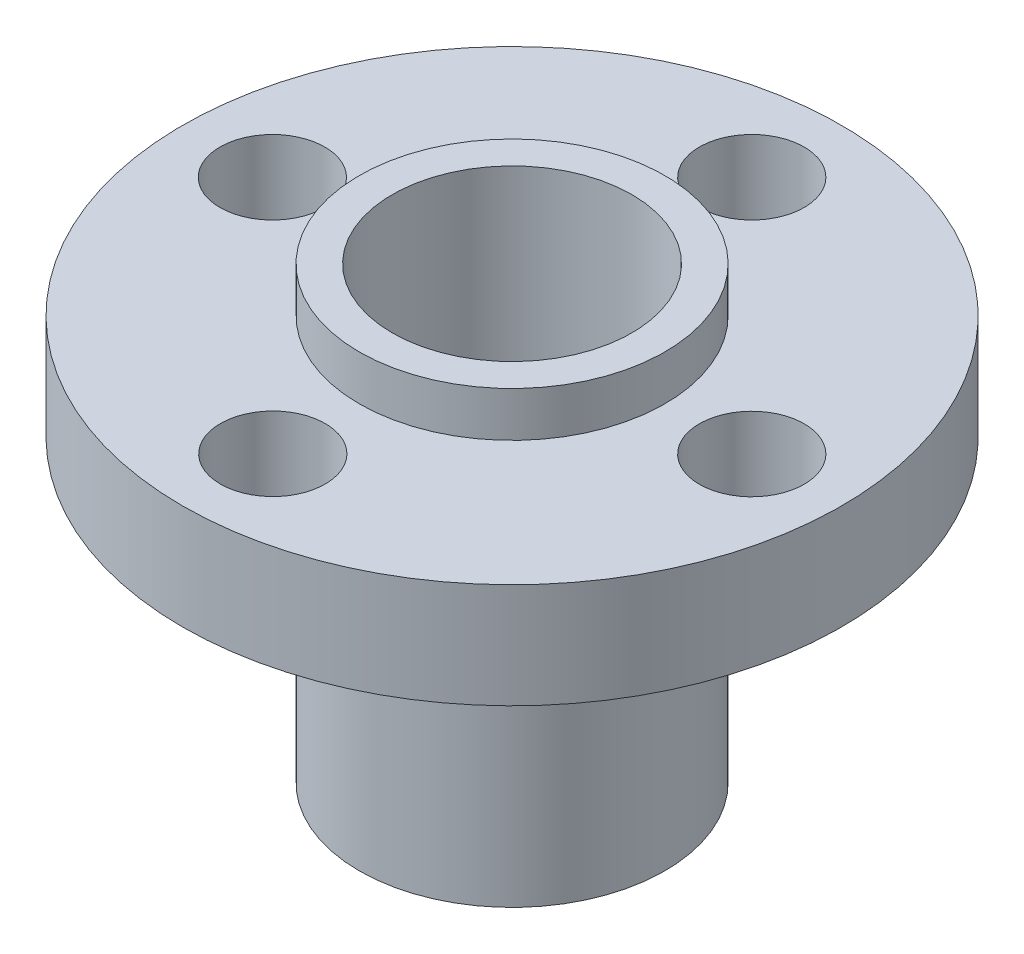
ISO-10303-21;
HEADER;
FILE_DESCRIPTION(('STEP AP214'),'2;1');
FILE_NAME('part.step','',(''),(''),'','','');
FILE_SCHEMA(('AUTOMOTIVE_DESIGN { 1 0 10303 214 1 1 1 1 }'));
ENDSEC;
DATA;
#1=APPLICATION_CONTEXT('core data for automotive mechanical design processes');
#2=APPLICATION_PROTOCOL_DEFINITION('international standard','automotive_design',2000,#1);
#3=PRODUCT_CONTEXT('',#1,'mechanical');
#4=PRODUCT('Part','Part','',(#3));
#5=PRODUCT_RELATED_PRODUCT_CATEGORY('part','',(#4));
#6=PRODUCT_DEFINITION_FORMATION('','',#4);
#7=PRODUCT_DEFINITION_CONTEXT('part definition',#1,'design');
#8=PRODUCT_DEFINITION('design','',#6,#7);
#9=PRODUCT_DEFINITION_SHAPE('','',#8);
#10=(LENGTH_UNIT() NAMED_UNIT(*) SI_UNIT(.MILLI.,.METRE.));
#11=(NAMED_UNIT(*) PLANE_ANGLE_UNIT() SI_UNIT($,.RADIAN.));
#12=(NAMED_UNIT(*) SI_UNIT($,.STERADIAN.) SOLID_ANGLE_UNIT());
#13=UNCERTAINTY_MEASURE_WITH_UNIT(LENGTH_MEASURE(1.E-05),#10,'distance_accuracy_value','');
#14=(GEOMETRIC_REPRESENTATION_CONTEXT(3) GLOBAL_UNCERTAINTY_ASSIGNED_CONTEXT((#13)) GLOBAL_UNIT_ASSIGNED_CONTEXT((#10,
#11,#12)) REPRESENTATION_CONTEXT('',''));
#15=CARTESIAN_POINT('',(0.,0.,0.));
#16=DIRECTION('',(0.,0.,1.));
#17=DIRECTION('',(1.,0.,0.));
#18=AXIS2_PLACEMENT_3D('',#15,#16,#17);
#19=CARTESIAN_POINT('',(-9.89044002391512,3.5,4.26796703500969));
#20=DIRECTION('',(0.,-1.,0.));
#21=DIRECTION('',(0.,0.,-1.));
#22=AXIS2_PLACEMENT_3D('',#19,#20,#21);
#23=CYLINDRICAL_SURFACE('',#22,1.75);
#24=CARTESIAN_POINT('',(-9.89044002391512,3.5,4.26796703500969));
#25=DIRECTION('',(0.,1.,0.));
#26=DIRECTION('',(0.,0.,1.));
#27=AXIS2_PLACEMENT_3D('',#24,#25,#26);
#28=CIRCLE('',#27,1.75);
#29=CARTESIAN_POINT('',(-9.89044002391512,3.5,6.01796703500969));
#30=VERTEX_POINT('',#29);
#31=EDGE_CURVE('E40',#30,#30,#28,.T.);
#32=ORIENTED_EDGE('',*,*,#31,.T.);
#33=EDGE_LOOP('',(#32));
#34=FACE_BOUND('',#33,.T.);
#35=CARTESIAN_POINT('',(-9.89044002391512,0.,4.26796703500969));
#36=DIRECTION('',(0.,1.,0.));
#37=DIRECTION('',(0.,0.,1.));
#38=AXIS2_PLACEMENT_3D('',#35,#36,#37);
#39=CIRCLE('',#38,1.75);
#40=CARTESIAN_POINT('',(-9.89044002391512,0.,6.01796703500969));
#41=VERTEX_POINT('',#40);
#42=EDGE_CURVE('E58',#41,#41,#39,.T.);
#43=ORIENTED_EDGE('',*,*,#42,.F.);
#44=EDGE_LOOP('',(#43));
#45=FACE_BOUND('',#44,.T.);
#46=ADVANCED_FACE('F32',(#34,#45),#23,.F.);
#47=CARTESIAN_POINT('',(-1.89044002391511,3.5,-3.71851279819777));
#48=DIRECTION('',(0.,-1.,0.));
#49=DIRECTION('',(0.,0.,-1.));
#50=AXIS2_PLACEMENT_3D('',#47,#48,#49);
#51=CYLINDRICAL_SURFACE('',#50,1.75);
#52=CARTESIAN_POINT('',(-1.89044002391511,3.5,-3.71851279819777));
#53=DIRECTION('',(0.,1.,0.));
#54=DIRECTION('',(0.,0.,1.));
#55=AXIS2_PLACEMENT_3D('',#52,#53,#54);
#56=CIRCLE('',#55,1.75);
#57=CARTESIAN_POINT('',(-1.89044002391511,3.5,-1.96851279819777));
#58=VERTEX_POINT('',#57);
#59=EDGE_CURVE('E45',#58,#58,#56,.T.);
#60=ORIENTED_EDGE('',*,*,#59,.T.);
#61=EDGE_LOOP('',(#60));
#62=FACE_BOUND('',#61,.T.);
#63=CARTESIAN_POINT('',(-1.89044002391511,0.,-3.71851279819777));
#64=DIRECTION('',(0.,1.,0.));
#65=DIRECTION('',(0.,0.,1.));
#66=AXIS2_PLACEMENT_3D('',#63,#64,#65);
#67=CIRCLE('',#66,1.75);
#68=CARTESIAN_POINT('',(-1.89044002391511,0.,-1.96851279819777));
#69=VERTEX_POINT('',#68);
#70=EDGE_CURVE('E56',#69,#69,#67,.T.);
#71=ORIENTED_EDGE('',*,*,#70,.F.);
#72=EDGE_LOOP('',(#71));
#73=FACE_BOUND('',#72,.T.);
#74=ADVANCED_FACE('F79',(#62,#73),#51,.F.);
#75=CARTESIAN_POINT('',(-9.89044002391512,3.5,-11.7185127981978));
#76=DIRECTION('',(0.,-1.,0.));
#77=DIRECTION('',(0.,0.,-1.));
#78=AXIS2_PLACEMENT_3D('',#75,#76,#77);
#79=CYLINDRICAL_SURFACE('',#78,1.75);
#80=CARTESIAN_POINT('',(-9.89044002391512,3.5,-11.7185127981978));
#81=DIRECTION('',(0.,1.,0.));
#82=DIRECTION('',(0.,0.,1.));
#83=AXIS2_PLACEMENT_3D('',#80,#81,#82);
#84=CIRCLE('',#83,1.75);
#85=CARTESIAN_POINT('',(-9.89044002391512,3.5,-9.96851279819777));
#86=VERTEX_POINT('',#85);
#87=EDGE_CURVE('E67',#86,#86,#84,.T.);
#88=ORIENTED_EDGE('',*,*,#87,.T.);
#89=EDGE_LOOP('',(#88));
#90=FACE_BOUND('',#89,.T.);
#91=CARTESIAN_POINT('',(-9.89044002391512,0.,-11.7185127981978));
#92=DIRECTION('',(0.,1.,0.));
#93=DIRECTION('',(0.,0.,1.));
#94=AXIS2_PLACEMENT_3D('',#91,#92,#93);
#95=CIRCLE('',#94,1.75);
#96=CARTESIAN_POINT('',(-9.89044002391512,0.,-9.96851279819777));
#97=VERTEX_POINT('',#96);
#98=EDGE_CURVE('E52',#97,#97,#95,.T.);
#99=ORIENTED_EDGE('',*,*,#98,.F.);
#100=EDGE_LOOP('',(#99));
#101=FACE_BOUND('',#100,.T.);
#102=ADVANCED_FACE('F97',(#90,#101),#79,.F.);
#103=CARTESIAN_POINT('',(-17.8904400239151,3.5,-3.71851279819777));
#104=DIRECTION('',(0.,-1.,0.));
#105=DIRECTION('',(0.,0.,-1.));
#106=AXIS2_PLACEMENT_3D('',#103,#104,#105);
#107=CYLINDRICAL_SURFACE('',#106,1.75);
#108=CARTESIAN_POINT('',(-17.8904400239151,3.5,-3.71851279819777));
#109=DIRECTION('',(0.,1.,0.));
#110=DIRECTION('',(0.,0.,1.));
#111=AXIS2_PLACEMENT_3D('',#108,#109,#110);
#112=CIRCLE('',#111,1.75);
#113=CARTESIAN_POINT('',(-17.8904400239151,3.5,-1.96851279819777));
#114=VERTEX_POINT('',#113);
#115=EDGE_CURVE('E63',#114,#114,#112,.T.);
#116=ORIENTED_EDGE('',*,*,#115,.T.);
#117=EDGE_LOOP('',(#116));
#118=FACE_BOUND('',#117,.T.);
#119=CARTESIAN_POINT('',(-17.8904400239151,0.,-3.71851279819777));
#120=DIRECTION('',(0.,1.,0.));
#121=DIRECTION('',(0.,0.,1.));
#122=AXIS2_PLACEMENT_3D('',#119,#120,#121);
#123=CIRCLE('',#122,1.75);
#124=CARTESIAN_POINT('',(-17.8904400239151,0.,-1.96851279819777));
#125=VERTEX_POINT('',#124);
#126=EDGE_CURVE('E49',#125,#125,#123,.T.);
#127=ORIENTED_EDGE('',*,*,#126,.F.);
#128=EDGE_LOOP('',(#127));
#129=FACE_BOUND('',#128,.T.);
#130=ADVANCED_FACE('F103',(#118,#129),#107,.F.);
#131=CARTESIAN_POINT('',(-9.89044002391512,3.5,-3.71851279819777));
#132=DIRECTION('',(0.,-1.,0.));
#133=DIRECTION('',(0.,0.,-1.));
#134=AXIS2_PLACEMENT_3D('',#131,#132,#133);
#135=CYLINDRICAL_SURFACE('',#134,4.);
#136=CARTESIAN_POINT('',(-9.89044002391512,5.,-3.71851279819777));
#137=DIRECTION('',(0.,1.,0.));
#138=DIRECTION('',(0.,0.,1.));
#139=AXIS2_PLACEMENT_3D('',#136,#137,#138);
#140=CIRCLE('',#139,4.);
#141=CARTESIAN_POINT('',(-9.89044002391512,5.,0.281487201802232));
#142=VERTEX_POINT('',#141);
#143=EDGE_CURVE('E145',#142,#142,#140,.T.);
#144=ORIENTED_EDGE('',*,*,#143,.T.);
#145=EDGE_LOOP('',(#144));
#146=FACE_BOUND('',#145,.T.);
#147=CARTESIAN_POINT('',(-9.89044002391512,-10.,-3.71851279819777));
#148=DIRECTION('',(0.,1.,0.));
#149=DIRECTION('',(0.,0.,1.));
#150=AXIS2_PLACEMENT_3D('',#147,#148,#149);
#151=CIRCLE('',#150,4.);
#152=CARTESIAN_POINT('',(-9.89044002391512,-10.,0.281487201802232));
#153=VERTEX_POINT('',#152);
#154=EDGE_CURVE('E156',#153,#153,#151,.T.);
#155=ORIENTED_EDGE('',*,*,#154,.F.);
#156=EDGE_LOOP('',(#155));
#157=FACE_BOUND('',#156,.T.);
#158=ADVANCED_FACE('F34',(#146,#157),#135,.F.);
#159=CARTESIAN_POINT('',(-9.89044002391512,3.5,-3.71851279819777));
#160=DIRECTION('',(0.,-1.,0.));
#161=DIRECTION('',(0.,0.,-1.));
#162=AXIS2_PLACEMENT_3D('',#159,#160,#161);
#163=CYLINDRICAL_SURFACE('',#162,11.);
#164=CARTESIAN_POINT('',(-9.89044002391512,3.5,-3.71851279819777));
#165=DIRECTION('',(0.,1.,0.));
#166=DIRECTION('',(0.,0.,1.));
#167=AXIS2_PLACEMENT_3D('',#164,#165,#166);
#168=CIRCLE('',#167,11.);
#169=CARTESIAN_POINT('',(-9.89044002391512,3.5,7.28148720180223));
#170=VERTEX_POINT('',#169);
#171=EDGE_CURVE('E10',#170,#170,#168,.T.);
#172=ORIENTED_EDGE('',*,*,#171,.F.);
#173=EDGE_LOOP('',(#172));
#174=FACE_BOUND('',#173,.T.);
#175=CARTESIAN_POINT('',(-9.89044002391512,0.,-3.71851279819777));
#176=DIRECTION('',(0.,1.,0.));
#177=DIRECTION('',(0.,0.,1.));
#178=AXIS2_PLACEMENT_3D('',#175,#176,#177);
#179=CIRCLE('',#178,11.);
#180=CARTESIAN_POINT('',(-9.89044002391512,0.,7.28148720180223));
#181=VERTEX_POINT('',#180);
#182=EDGE_CURVE('E36',#181,#181,#179,.T.);
#183=ORIENTED_EDGE('',*,*,#182,.T.);
#184=EDGE_LOOP('',(#183));
#185=FACE_BOUND('',#184,.T.);
#186=ADVANCED_FACE('F86',(#174,#185),#163,.T.);
#187=CARTESIAN_POINT('',(0.,3.5,0.));
#188=DIRECTION('',(0.,1.,0.));
#189=DIRECTION('',(0.,0.,1.));
#190=AXIS2_PLACEMENT_3D('',#187,#188,#189);
#191=PLANE('',#190);
#192=CARTESIAN_POINT('',(-9.89044002391512,3.5,-3.71851279819777));
#193=DIRECTION('',(0.,1.,0.));
#194=DIRECTION('',(0.,0.,1.));
#195=AXIS2_PLACEMENT_3D('',#192,#193,#194);
#196=CIRCLE('',#195,5.1);
#197=CARTESIAN_POINT('',(-9.89044002391512,3.5,1.38148720180223));
#198=VERTEX_POINT('',#197);
#199=EDGE_CURVE('E150',#198,#198,#196,.F.);
#200=ORIENTED_EDGE('',*,*,#199,.T.);
#201=EDGE_LOOP('',(#200));
#202=FACE_BOUND('',#201,.T.);
#203=ORIENTED_EDGE('',*,*,#115,.F.);
#204=EDGE_LOOP('',(#203));
#205=FACE_BOUND('',#204,.T.);
#206=ORIENTED_EDGE('',*,*,#87,.F.);
#207=EDGE_LOOP('',(#206));
#208=FACE_BOUND('',#207,.T.);
#209=ORIENTED_EDGE('',*,*,#59,.F.);
#210=EDGE_LOOP('',(#209));
#211=FACE_BOUND('',#210,.T.);
#212=ORIENTED_EDGE('',*,*,#31,.F.);
#213=EDGE_LOOP('',(#212));
#214=FACE_BOUND('',#213,.T.);
#215=ORIENTED_EDGE('',*,*,#171,.T.);
#216=EDGE_LOOP('',(#215));
#217=FACE_BOUND('',#216,.T.);
#218=ADVANCED_FACE('F82',(#202,#205,#208,#211,#214,#217),#191,.T.);
#219=CARTESIAN_POINT('',(0.,0.,0.));
#220=DIRECTION('',(0.,1.,0.));
#221=DIRECTION('',(0.,0.,1.));
#222=AXIS2_PLACEMENT_3D('',#219,#220,#221);
#223=PLANE('',#222);
#224=CARTESIAN_POINT('',(-9.89044002391512,0.,-3.71851279819777));
#225=DIRECTION('',(0.,1.,0.));
#226=DIRECTION('',(0.,0.,1.));
#227=AXIS2_PLACEMENT_3D('',#224,#225,#226);
#228=CIRCLE('',#227,5.1);
#229=CARTESIAN_POINT('',(-9.89044002391512,0.,1.38148720180223));
#230=VERTEX_POINT('',#229);
#231=EDGE_CURVE('E74',#230,#230,#228,.T.);
#232=ORIENTED_EDGE('',*,*,#231,.T.);
#233=EDGE_LOOP('',(#232));
#234=FACE_BOUND('',#233,.T.);
#235=ORIENTED_EDGE('',*,*,#126,.T.);
#236=EDGE_LOOP('',(#235));
#237=FACE_BOUND('',#236,.T.);
#238=ORIENTED_EDGE('',*,*,#98,.T.);
#239=EDGE_LOOP('',(#238));
#240=FACE_BOUND('',#239,.T.);
#241=ORIENTED_EDGE('',*,*,#70,.T.);
#242=EDGE_LOOP('',(#241));
#243=FACE_BOUND('',#242,.T.);
#244=ORIENTED_EDGE('',*,*,#42,.T.);
#245=EDGE_LOOP('',(#244));
#246=FACE_BOUND('',#245,.T.);
#247=ORIENTED_EDGE('',*,*,#182,.F.);
#248=EDGE_LOOP('',(#247));
#249=FACE_BOUND('',#248,.T.);
#250=ADVANCED_FACE('F85',(#234,#237,#240,#243,#246,#249),#223,.F.);
#251=CARTESIAN_POINT('',(-9.89044002391512,-10.,-3.71851279819777));
#252=DIRECTION('',(0.,1.,0.));
#253=DIRECTION('',(0.,0.,1.));
#254=AXIS2_PLACEMENT_3D('',#251,#252,#253);
#255=CYLINDRICAL_SURFACE('',#254,5.1);
#256=CARTESIAN_POINT('',(-9.89044002391512,-10.,-3.71851279819777));
#257=DIRECTION('',(0.,1.,0.));
#258=DIRECTION('',(0.,0.,1.));
#259=AXIS2_PLACEMENT_3D('',#256,#257,#258);
#260=CIRCLE('',#259,5.1);
#261=CARTESIAN_POINT('',(-9.89044002391512,-10.,1.38148720180223));
#262=VERTEX_POINT('',#261);
#263=EDGE_CURVE('E53',#262,#262,#260,.T.);
#264=ORIENTED_EDGE('',*,*,#263,.T.);
#265=EDGE_LOOP('',(#264));
#266=FACE_BOUND('',#265,.T.);
#267=ORIENTED_EDGE('',*,*,#231,.F.);
#268=EDGE_LOOP('',(#267));
#269=FACE_BOUND('',#268,.T.);
#270=ADVANCED_FACE('F115',(#266,#269),#255,.T.);
#271=CARTESIAN_POINT('',(0.,-10.,0.));
#272=DIRECTION('',(0.,1.,0.));
#273=DIRECTION('',(0.,0.,1.));
#274=AXIS2_PLACEMENT_3D('',#271,#272,#273);
#275=PLANE('',#274);
#276=ORIENTED_EDGE('',*,*,#154,.T.);
#277=EDGE_LOOP('',(#276));
#278=FACE_BOUND('',#277,.T.);
#279=ORIENTED_EDGE('',*,*,#263,.F.);
#280=EDGE_LOOP('',(#279));
#281=FACE_BOUND('',#280,.T.);
#282=ADVANCED_FACE('F125',(#278,#281),#275,.F.);
#283=CARTESIAN_POINT('',(-9.89044002391512,5.,-3.71851279819777));
#284=DIRECTION('',(0.,-1.,0.));
#285=DIRECTION('',(0.,0.,-1.));
#286=AXIS2_PLACEMENT_3D('',#283,#284,#285);
#287=CYLINDRICAL_SURFACE('',#286,5.1);
#288=ORIENTED_EDGE('',*,*,#199,.F.);
#289=EDGE_LOOP('',(#288));
#290=FACE_BOUND('',#289,.T.);
#291=CARTESIAN_POINT('',(-9.89044002391512,5.,-3.71851279819777));
#292=DIRECTION('',(0.,1.,0.));
#293=DIRECTION('',(0.,0.,1.));
#294=AXIS2_PLACEMENT_3D('',#291,#292,#293);
#295=CIRCLE('',#294,5.1);
#296=CARTESIAN_POINT('',(-9.89044002391512,5.,1.38148720180223));
#297=VERTEX_POINT('',#296);
#298=EDGE_CURVE('E148',#297,#297,#295,.T.);
#299=ORIENTED_EDGE('',*,*,#298,.F.);
#300=EDGE_LOOP('',(#299));
#301=FACE_BOUND('',#300,.T.);
#302=ADVANCED_FACE('F132',(#290,#301),#287,.T.);
#303=CARTESIAN_POINT('',(0.,5.,0.));
#304=DIRECTION('',(0.,1.,0.));
#305=DIRECTION('',(0.,0.,1.));
#306=AXIS2_PLACEMENT_3D('',#303,#304,#305);
#307=PLANE('',#306);
#308=ORIENTED_EDGE('',*,*,#143,.F.);
#309=EDGE_LOOP('',(#308));
#310=FACE_BOUND('',#309,.T.);
#311=ORIENTED_EDGE('',*,*,#298,.T.);
#312=EDGE_LOOP('',(#311));
#313=FACE_BOUND('',#312,.T.);
#314=ADVANCED_FACE('F136',(#310,#313),#307,.T.);
#315=CLOSED_SHELL('',(#46,#74,#102,#130,#158,#186,#218,#250,#270,#282,#302,#314));
#316=MANIFOLD_SOLID_BREP('B2',#315);
#317=ADVANCED_BREP_SHAPE_REPRESENTATION('',(#18,#316),#14);
#318=SHAPE_DEFINITION_REPRESENTATION(#9,#317);
ENDSEC;
END-ISO-10303-21;
